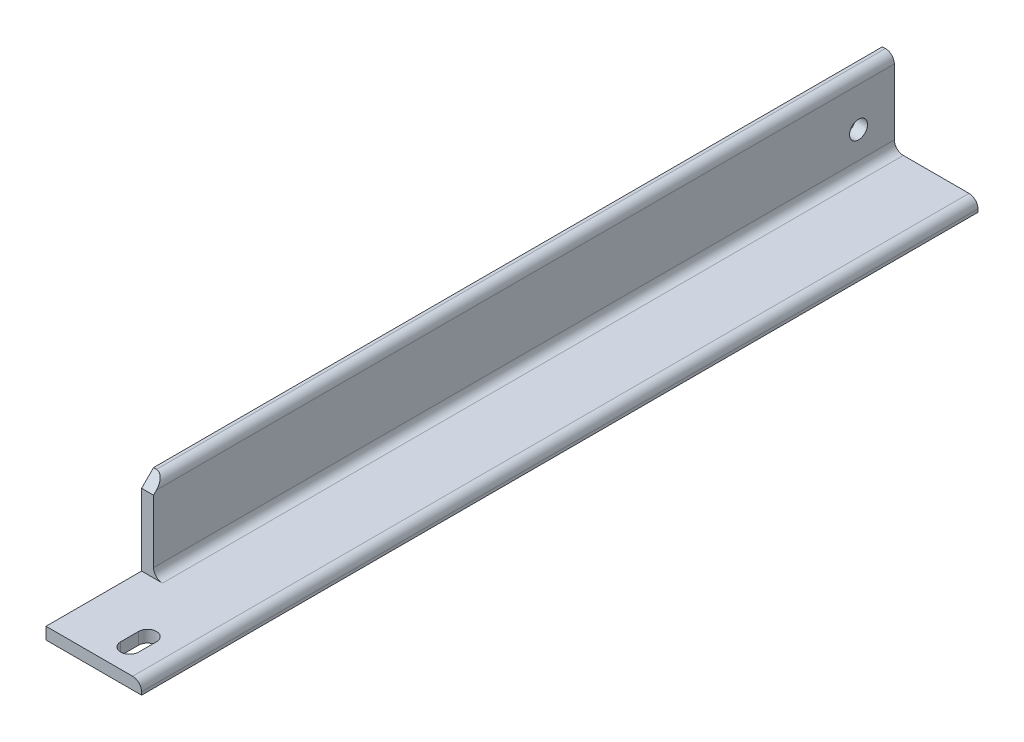
ISO-10303-21;
HEADER;
FILE_DESCRIPTION(('STEP AP214'),'2;1');
FILE_NAME('part.step','',(''),(''),'','','');
FILE_SCHEMA(('AUTOMOTIVE_DESIGN { 1 0 10303 214 1 1 1 1 }'));
ENDSEC;
DATA;
#1=APPLICATION_CONTEXT('core data for automotive mechanical design processes');
#2=APPLICATION_PROTOCOL_DEFINITION('international standard','automotive_design',2000,#1);
#3=PRODUCT_CONTEXT('',#1,'mechanical');
#4=PRODUCT('Part','Part','',(#3));
#5=PRODUCT_RELATED_PRODUCT_CATEGORY('part','',(#4));
#6=PRODUCT_DEFINITION_FORMATION('','',#4);
#7=PRODUCT_DEFINITION_CONTEXT('part definition',#1,'design');
#8=PRODUCT_DEFINITION('design','',#6,#7);
#9=PRODUCT_DEFINITION_SHAPE('','',#8);
#10=(LENGTH_UNIT() NAMED_UNIT(*) SI_UNIT(.MILLI.,.METRE.));
#11=(NAMED_UNIT(*) PLANE_ANGLE_UNIT() SI_UNIT($,.RADIAN.));
#12=(NAMED_UNIT(*) SI_UNIT($,.STERADIAN.) SOLID_ANGLE_UNIT());
#13=UNCERTAINTY_MEASURE_WITH_UNIT(LENGTH_MEASURE(1.E-05),#10,'distance_accuracy_value','');
#14=(GEOMETRIC_REPRESENTATION_CONTEXT(3) GLOBAL_UNCERTAINTY_ASSIGNED_CONTEXT((#13)) GLOBAL_UNIT_ASSIGNED_CONTEXT((#10,
#11,#12)) REPRESENTATION_CONTEXT('',''));
#15=CARTESIAN_POINT('',(0.,0.,0.));
#16=DIRECTION('',(0.,0.,1.));
#17=DIRECTION('',(1.,0.,0.));
#18=AXIS2_PLACEMENT_3D('',#15,#16,#17);
#19=CARTESIAN_POINT('',(0.,0.,444.5));
#20=DIRECTION('',(1.,0.,0.));
#21=DIRECTION('',(0.,0.,-1.));
#22=AXIS2_PLACEMENT_3D('',#19,#20,#21);
#23=PLANE('',#22);
#24=DIRECTION('',(0.,0.707106781186547,-0.707106781186548));
#25=VECTOR('',#24,1.);
#26=CARTESIAN_POINT('',(0.,88.9,342.9));
#27=LINE('',#26,#25);
#28=CARTESIAN_POINT('',(0.,88.9,342.9));
#29=VERTEX_POINT('',#28);
#30=CARTESIAN_POINT('',(0.,101.6,330.2));
#31=VERTEX_POINT('',#30);
#32=EDGE_CURVE('E184',#29,#31,#27,.T.);
#33=ORIENTED_EDGE('',*,*,#32,.T.);
#34=DIRECTION('',(0.,0.,-1.));
#35=VECTOR('',#34,1.);
#36=CARTESIAN_POINT('',(0.,101.6,444.5));
#37=LINE('',#36,#35);
#38=CARTESIAN_POINT('',(0.,101.6,-444.5));
#39=VERTEX_POINT('',#38);
#40=EDGE_CURVE('E240',#31,#39,#37,.T.);
#41=ORIENTED_EDGE('',*,*,#40,.T.);
#42=DIRECTION('',(0.,-1.,0.));
#43=VECTOR('',#42,1.);
#44=CARTESIAN_POINT('',(0.,0.,-444.5));
#45=LINE('',#44,#43);
#46=CARTESIAN_POINT('',(0.,0.,-444.5));
#47=VERTEX_POINT('',#46);
#48=EDGE_CURVE('E207',#39,#47,#45,.T.);
#49=ORIENTED_EDGE('',*,*,#48,.T.);
#50=DIRECTION('',(0.,0.,-1.));
#51=VECTOR('',#50,1.);
#52=CARTESIAN_POINT('',(0.,0.,444.5));
#53=LINE('',#52,#51);
#54=CARTESIAN_POINT('',(0.,0.,444.5));
#55=VERTEX_POINT('',#54);
#56=EDGE_CURVE('E215',#55,#47,#53,.T.);
#57=ORIENTED_EDGE('',*,*,#56,.F.);
#58=DIRECTION('',(0.,-1.,0.));
#59=VECTOR('',#58,1.);
#60=CARTESIAN_POINT('',(0.,0.,444.5));
#61=LINE('',#60,#59);
#62=CARTESIAN_POINT('',(0.,12.7,444.5));
#63=VERTEX_POINT('',#62);
#64=EDGE_CURVE('E213',#63,#55,#61,.T.);
#65=ORIENTED_EDGE('',*,*,#64,.F.);
#66=DIRECTION('',(0.,0.,-1.));
#67=VECTOR('',#66,1.);
#68=CARTESIAN_POINT('',(0.,12.7,444.5));
#69=LINE('',#68,#67);
#70=CARTESIAN_POINT('',(0.,12.7,342.9));
#71=VERTEX_POINT('',#70);
#72=EDGE_CURVE('E178',#63,#71,#69,.T.);
#73=ORIENTED_EDGE('',*,*,#72,.T.);
#74=DIRECTION('',(0.,1.,0.));
#75=VECTOR('',#74,1.);
#76=CARTESIAN_POINT('',(0.,12.7,342.9));
#77=LINE('',#76,#75);
#78=EDGE_CURVE('E181',#71,#29,#77,.T.);
#79=ORIENTED_EDGE('',*,*,#78,.T.);
#80=EDGE_LOOP('',(#33,#41,#49,#57,#65,#73,#79));
#81=FACE_BOUND('',#80,.T.);
#82=CARTESIAN_POINT('',(0.,50.8,-406.4));
#83=DIRECTION('',(-1.,0.,0.));
#84=DIRECTION('',(0.,0.,1.));
#85=AXIS2_PLACEMENT_3D('',#82,#83,#84);
#86=CIRCLE('',#85,9.52499999999998);
#87=CARTESIAN_POINT('',(0.,50.8,-396.875));
#88=VERTEX_POINT('',#87);
#89=EDGE_CURVE('E462',#88,#88,#86,.T.);
#90=ORIENTED_EDGE('',*,*,#89,.F.);
#91=EDGE_LOOP('',(#90));
#92=FACE_BOUND('',#91,.T.);
#93=ADVANCED_FACE('F35',(#81,#92),#23,.F.);
#94=CARTESIAN_POINT('',(101.6,0.,444.5));
#95=DIRECTION('',(0.,1.,0.));
#96=DIRECTION('',(-1.,0.,0.));
#97=AXIS2_PLACEMENT_3D('',#94,#95,#96);
#98=PLANE('',#97);
#99=DIRECTION('',(1.,0.,0.));
#100=VECTOR('',#99,1.);
#101=CARTESIAN_POINT('',(101.6,0.,-444.5));
#102=LINE('',#101,#100);
#103=CARTESIAN_POINT('',(101.6,0.,-444.5));
#104=VERTEX_POINT('',#103);
#105=EDGE_CURVE('E202',#47,#104,#102,.T.);
#106=ORIENTED_EDGE('',*,*,#105,.T.);
#107=DIRECTION('',(0.,0.,-1.));
#108=VECTOR('',#107,1.);
#109=CARTESIAN_POINT('',(101.6,0.,444.5));
#110=LINE('',#109,#108);
#111=CARTESIAN_POINT('',(101.6,0.,444.5));
#112=VERTEX_POINT('',#111);
#113=EDGE_CURVE('E11',#112,#104,#110,.T.);
#114=ORIENTED_EDGE('',*,*,#113,.F.);
#115=DIRECTION('',(1.,0.,0.));
#116=VECTOR('',#115,1.);
#117=CARTESIAN_POINT('',(101.6,0.,444.5));
#118=LINE('',#117,#116);
#119=EDGE_CURVE('E203',#55,#112,#118,.T.);
#120=ORIENTED_EDGE('',*,*,#119,.F.);
#121=ORIENTED_EDGE('',*,*,#56,.T.);
#122=EDGE_LOOP('',(#106,#114,#120,#121));
#123=FACE_BOUND('',#122,.T.);
#124=CARTESIAN_POINT('',(63.5,0.,419.1));
#125=DIRECTION('',(0.,1.,0.));
#126=DIRECTION('',(-1.,0.,0.));
#127=AXIS2_PLACEMENT_3D('',#124,#125,#126);
#128=CIRCLE('',#127,9.52500000000001);
#129=CARTESIAN_POINT('',(53.975,0.,419.1));
#130=VERTEX_POINT('',#129);
#131=CARTESIAN_POINT('',(73.025,0.,419.1));
#132=VERTEX_POINT('',#131);
#133=EDGE_CURVE('E50',#130,#132,#128,.T.);
#134=ORIENTED_EDGE('',*,*,#133,.T.);
#135=DIRECTION('',(0.,0.,-1.));
#136=VECTOR('',#135,1.);
#137=CARTESIAN_POINT('',(73.025,0.,419.1));
#138=LINE('',#137,#136);
#139=CARTESIAN_POINT('',(73.025,0.,400.05));
#140=VERTEX_POINT('',#139);
#141=EDGE_CURVE('E160',#132,#140,#138,.T.);
#142=ORIENTED_EDGE('',*,*,#141,.T.);
#143=CARTESIAN_POINT('',(63.5,0.,400.05));
#144=DIRECTION('',(0.,1.,0.));
#145=DIRECTION('',(-1.,0.,0.));
#146=AXIS2_PLACEMENT_3D('',#143,#144,#145);
#147=CIRCLE('',#146,9.52500000000001);
#148=CARTESIAN_POINT('',(53.975,0.,400.05));
#149=VERTEX_POINT('',#148);
#150=EDGE_CURVE('E168',#140,#149,#147,.T.);
#151=ORIENTED_EDGE('',*,*,#150,.T.);
#152=DIRECTION('',(0.,0.,1.));
#153=VECTOR('',#152,1.);
#154=CARTESIAN_POINT('',(53.975,0.,419.1));
#155=LINE('',#154,#153);
#156=EDGE_CURVE('E154',#149,#130,#155,.T.);
#157=ORIENTED_EDGE('',*,*,#156,.T.);
#158=EDGE_LOOP('',(#134,#142,#151,#157));
#159=FACE_BOUND('',#158,.T.);
#160=ADVANCED_FACE('F37',(#123,#159),#98,.F.);
#161=CARTESIAN_POINT('',(22.225,12.7,444.5));
#162=DIRECTION('',(0.,-1.,0.));
#163=DIRECTION('',(1.,0.,0.));
#164=AXIS2_PLACEMENT_3D('',#161,#162,#163);
#165=PLANE('',#164);
#166=DIRECTION('',(-1.,0.,0.));
#167=VECTOR('',#166,1.);
#168=CARTESIAN_POINT('',(22.225,12.7,-444.5));
#169=LINE('',#168,#167);
#170=CARTESIAN_POINT('',(92.08008,12.7,-444.5));
#171=VERTEX_POINT('',#170);
#172=CARTESIAN_POINT('',(22.225,12.7,-444.5));
#173=VERTEX_POINT('',#172);
#174=EDGE_CURVE('E222',#171,#173,#169,.T.);
#175=ORIENTED_EDGE('',*,*,#174,.T.);
#176=DIRECTION('',(0.,0.,-1.));
#177=VECTOR('',#176,1.);
#178=CARTESIAN_POINT('',(22.225,12.7,444.5));
#179=LINE('',#178,#177);
#180=CARTESIAN_POINT('',(22.225,12.7,342.9));
#181=VERTEX_POINT('',#180);
#182=EDGE_CURVE('E248',#181,#173,#179,.T.);
#183=ORIENTED_EDGE('',*,*,#182,.F.);
#184=DIRECTION('',(-1.,0.,0.));
#185=VECTOR('',#184,1.);
#186=CARTESIAN_POINT('',(101.601,12.7,342.9));
#187=LINE('',#186,#185);
#188=EDGE_CURVE('E191',#181,#71,#187,.T.);
#189=ORIENTED_EDGE('',*,*,#188,.T.);
#190=ORIENTED_EDGE('',*,*,#72,.F.);
#191=DIRECTION('',(-1.,0.,0.));
#192=VECTOR('',#191,1.);
#193=CARTESIAN_POINT('',(22.225,12.7,444.5));
#194=LINE('',#193,#192);
#195=CARTESIAN_POINT('',(92.08008,12.7,444.5));
#196=VERTEX_POINT('',#195);
#197=EDGE_CURVE('E211',#196,#63,#194,.T.);
#198=ORIENTED_EDGE('',*,*,#197,.F.);
#199=DIRECTION('',(0.,0.,-1.));
#200=VECTOR('',#199,1.);
#201=CARTESIAN_POINT('',(92.08008,12.7,444.5));
#202=LINE('',#201,#200);
#203=EDGE_CURVE('E250',#196,#171,#202,.T.);
#204=ORIENTED_EDGE('',*,*,#203,.T.);
#205=EDGE_LOOP('',(#175,#183,#189,#190,#198,#204));
#206=FACE_BOUND('',#205,.T.);
#207=CARTESIAN_POINT('',(63.5,12.7,419.1));
#208=DIRECTION('',(0.,-1.,0.));
#209=DIRECTION('',(1.,0.,0.));
#210=AXIS2_PLACEMENT_3D('',#207,#208,#209);
#211=CIRCLE('',#210,9.52500000000001);
#212=CARTESIAN_POINT('',(73.025,12.7,419.1));
#213=VERTEX_POINT('',#212);
#214=CARTESIAN_POINT('',(53.975,12.7,419.1));
#215=VERTEX_POINT('',#214);
#216=EDGE_CURVE('E152',#213,#215,#211,.T.);
#217=ORIENTED_EDGE('',*,*,#216,.T.);
#218=DIRECTION('',(0.,0.,-1.));
#219=VECTOR('',#218,1.);
#220=CARTESIAN_POINT('',(53.975,12.7,419.1));
#221=LINE('',#220,#219);
#222=CARTESIAN_POINT('',(53.975,12.7,400.05));
#223=VERTEX_POINT('',#222);
#224=EDGE_CURVE('E141',#215,#223,#221,.T.);
#225=ORIENTED_EDGE('',*,*,#224,.T.);
#226=CARTESIAN_POINT('',(63.5,12.7,400.05));
#227=DIRECTION('',(0.,-1.,0.));
#228=DIRECTION('',(1.,0.,0.));
#229=AXIS2_PLACEMENT_3D('',#226,#227,#228);
#230=CIRCLE('',#229,9.52500000000001);
#231=CARTESIAN_POINT('',(73.025,12.7,400.05));
#232=VERTEX_POINT('',#231);
#233=EDGE_CURVE('E162',#223,#232,#230,.T.);
#234=ORIENTED_EDGE('',*,*,#233,.T.);
#235=DIRECTION('',(0.,0.,1.));
#236=VECTOR('',#235,1.);
#237=CARTESIAN_POINT('',(73.025,12.7,419.1));
#238=LINE('',#237,#236);
#239=EDGE_CURVE('E158',#232,#213,#238,.T.);
#240=ORIENTED_EDGE('',*,*,#239,.T.);
#241=EDGE_LOOP('',(#217,#225,#234,#240));
#242=FACE_BOUND('',#241,.T.);
#243=ADVANCED_FACE('F157',(#206,#242),#165,.F.);
#244=CARTESIAN_POINT('',(22.225,22.225,444.5));
#245=DIRECTION('',(0.,0.,-1.));
#246=DIRECTION('',(-1.,0.,0.));
#247=AXIS2_PLACEMENT_3D('',#244,#245,#246);
#248=CYLINDRICAL_SURFACE('',#247,9.525);
#249=CARTESIAN_POINT('',(22.225,22.225,342.9));
#250=DIRECTION('',(0.,0.,1.));
#251=DIRECTION('',(1.,0.,0.));
#252=AXIS2_PLACEMENT_3D('',#249,#250,#251);
#253=CIRCLE('',#252,9.525);
#254=CARTESIAN_POINT('',(12.7,22.225,342.9));
#255=VERTEX_POINT('',#254);
#256=EDGE_CURVE('E199',#255,#181,#253,.T.);
#257=ORIENTED_EDGE('',*,*,#256,.T.);
#258=ORIENTED_EDGE('',*,*,#182,.T.);
#259=CARTESIAN_POINT('',(22.225,22.225,-444.5));
#260=DIRECTION('',(0.,0.,-1.));
#261=DIRECTION('',(-1.,0.,0.));
#262=AXIS2_PLACEMENT_3D('',#259,#260,#261);
#263=CIRCLE('',#262,9.525);
#264=CARTESIAN_POINT('',(12.7,22.225,-444.5));
#265=VERTEX_POINT('',#264);
#266=EDGE_CURVE('E225',#173,#265,#263,.T.);
#267=ORIENTED_EDGE('',*,*,#266,.T.);
#268=DIRECTION('',(0.,0.,-1.));
#269=VECTOR('',#268,1.);
#270=CARTESIAN_POINT('',(12.7,22.225,444.5));
#271=LINE('',#270,#269);
#272=EDGE_CURVE('E246',#255,#265,#271,.T.);
#273=ORIENTED_EDGE('',*,*,#272,.F.);
#274=EDGE_LOOP('',(#257,#258,#267,#273));
#275=FACE_BOUND('',#274,.T.);
#276=ADVANCED_FACE('F297',(#275),#248,.F.);
#277=CARTESIAN_POINT('',(12.7,92.08008,444.5));
#278=DIRECTION('',(-1.,0.,0.));
#279=DIRECTION('',(0.,-1.,0.));
#280=AXIS2_PLACEMENT_3D('',#277,#278,#279);
#281=PLANE('',#280);
#282=CARTESIAN_POINT('',(12.7,50.8,-406.4));
#283=DIRECTION('',(-1.,0.,0.));
#284=DIRECTION('',(0.,-1.,0.));
#285=AXIS2_PLACEMENT_3D('',#282,#283,#284);
#286=CIRCLE('',#285,9.52499999999999);
#287=CARTESIAN_POINT('',(12.7,41.275,-406.4));
#288=VERTEX_POINT('',#287);
#289=EDGE_CURVE('E459',#288,#288,#286,.T.);
#290=ORIENTED_EDGE('',*,*,#289,.T.);
#291=EDGE_LOOP('',(#290));
#292=FACE_BOUND('',#291,.T.);
#293=DIRECTION('',(0.,-1.,0.));
#294=VECTOR('',#293,1.);
#295=CARTESIAN_POINT('',(12.7,12.7,342.9));
#296=LINE('',#295,#294);
#297=CARTESIAN_POINT('',(12.7,88.9,342.9));
#298=VERTEX_POINT('',#297);
#299=EDGE_CURVE('E148',#298,#255,#296,.T.);
#300=ORIENTED_EDGE('',*,*,#299,.T.);
#301=ORIENTED_EDGE('',*,*,#272,.T.);
#302=DIRECTION('',(0.,1.,0.));
#303=VECTOR('',#302,1.);
#304=CARTESIAN_POINT('',(12.7,92.08008,-444.5));
#305=LINE('',#304,#303);
#306=CARTESIAN_POINT('',(12.7,92.08008,-444.5));
#307=VERTEX_POINT('',#306);
#308=EDGE_CURVE('E228',#265,#307,#305,.T.);
#309=ORIENTED_EDGE('',*,*,#308,.T.);
#310=DIRECTION('',(0.,0.,-1.));
#311=VECTOR('',#310,1.);
#312=CARTESIAN_POINT('',(12.7,92.08008,444.5));
#313=LINE('',#312,#311);
#314=CARTESIAN_POINT('',(12.7,92.08008,339.71992));
#315=VERTEX_POINT('',#314);
#316=EDGE_CURVE('E244',#315,#307,#313,.T.);
#317=ORIENTED_EDGE('',*,*,#316,.F.);
#318=DIRECTION('',(0.,-0.707106781186547,0.707106781186548));
#319=VECTOR('',#318,1.);
#320=CARTESIAN_POINT('',(12.7,88.9,342.9));
#321=LINE('',#320,#319);
#322=EDGE_CURVE('E196',#315,#298,#321,.T.);
#323=ORIENTED_EDGE('',*,*,#322,.T.);
#324=EDGE_LOOP('',(#300,#301,#309,#317,#323));
#325=FACE_BOUND('',#324,.T.);
#326=ADVANCED_FACE('F294',(#292,#325),#281,.F.);
#327=CARTESIAN_POINT('',(3.18008,92.08008,444.5));
#328=DIRECTION('',(0.,0.,-1.));
#329=DIRECTION('',(-1.,0.,0.));
#330=AXIS2_PLACEMENT_3D('',#327,#328,#329);
#331=CYLINDRICAL_SURFACE('',#330,9.51992);
#332=CARTESIAN_POINT('',(3.18008,92.08008,339.71992));
#333=DIRECTION('',(0.,0.707106781186548,0.707106781186547));
#334=DIRECTION('',(0.,0.707106781186547,-0.707106781186548));
#335=AXIS2_PLACEMENT_3D('',#332,#333,#334);
#336=ELLIPSE('',#335,13.4631999767069,9.51992);
#337=CARTESIAN_POINT('',(3.18008,101.6,330.2));
#338=VERTEX_POINT('',#337);
#339=EDGE_CURVE('E193',#338,#315,#336,.F.);
#340=ORIENTED_EDGE('',*,*,#339,.T.);
#341=ORIENTED_EDGE('',*,*,#316,.T.);
#342=CARTESIAN_POINT('',(3.18008,92.08008,-444.5));
#343=DIRECTION('',(0.,0.,1.));
#344=DIRECTION('',(-1.,0.,0.));
#345=AXIS2_PLACEMENT_3D('',#342,#343,#344);
#346=CIRCLE('',#345,9.51992);
#347=CARTESIAN_POINT('',(3.18008,101.6,-444.5));
#348=VERTEX_POINT('',#347);
#349=EDGE_CURVE('E231',#307,#348,#346,.T.);
#350=ORIENTED_EDGE('',*,*,#349,.T.);
#351=DIRECTION('',(0.,0.,-1.));
#352=VECTOR('',#351,1.);
#353=CARTESIAN_POINT('',(3.18008,101.6,444.5));
#354=LINE('',#353,#352);
#355=EDGE_CURVE('E242',#338,#348,#354,.T.);
#356=ORIENTED_EDGE('',*,*,#355,.F.);
#357=EDGE_LOOP('',(#340,#341,#350,#356));
#358=FACE_BOUND('',#357,.T.);
#359=ADVANCED_FACE('F291',(#358),#331,.T.);
#360=CARTESIAN_POINT('',(0.,101.6,444.5));
#361=DIRECTION('',(0.,-1.,0.));
#362=DIRECTION('',(0.,0.,-1.));
#363=AXIS2_PLACEMENT_3D('',#360,#361,#362);
#364=PLANE('',#363);
#365=DIRECTION('',(-1.,0.,0.));
#366=VECTOR('',#365,1.);
#367=CARTESIAN_POINT('',(101.601,101.6,330.2));
#368=LINE('',#367,#366);
#369=EDGE_CURVE('E187',#338,#31,#368,.T.);
#370=ORIENTED_EDGE('',*,*,#369,.F.);
#371=ORIENTED_EDGE('',*,*,#355,.T.);
#372=DIRECTION('',(-1.,0.,0.));
#373=VECTOR('',#372,1.);
#374=CARTESIAN_POINT('',(0.,101.6,-444.5));
#375=LINE('',#374,#373);
#376=EDGE_CURVE('E234',#348,#39,#375,.T.);
#377=ORIENTED_EDGE('',*,*,#376,.T.);
#378=ORIENTED_EDGE('',*,*,#40,.F.);
#379=EDGE_LOOP('',(#370,#371,#377,#378));
#380=FACE_BOUND('',#379,.T.);
#381=ADVANCED_FACE('F288',(#380),#364,.F.);
#382=CARTESIAN_POINT('',(3.18008,92.08008,444.5));
#383=DIRECTION('',(0.,0.,-1.));
#384=DIRECTION('',(-1.,0.,0.));
#385=AXIS2_PLACEMENT_3D('',#382,#383,#384);
#386=PLANE('',#385);
#387=ORIENTED_EDGE('',*,*,#197,.T.);
#388=ORIENTED_EDGE('',*,*,#64,.T.);
#389=ORIENTED_EDGE('',*,*,#119,.T.);
#390=DIRECTION('',(0.,1.,0.));
#391=VECTOR('',#390,1.);
#392=CARTESIAN_POINT('',(101.6,3.18008,444.5));
#393=LINE('',#392,#391);
#394=CARTESIAN_POINT('',(101.6,3.18008,444.5));
#395=VERTEX_POINT('',#394);
#396=EDGE_CURVE('E206',#112,#395,#393,.T.);
#397=ORIENTED_EDGE('',*,*,#396,.T.);
#398=CARTESIAN_POINT('',(92.08008,3.18008,444.5));
#399=DIRECTION('',(0.,0.,1.));
#400=DIRECTION('',(1.,0.,0.));
#401=AXIS2_PLACEMENT_3D('',#398,#399,#400);
#402=CIRCLE('',#401,9.51991999999999);
#403=EDGE_CURVE('E209',#395,#196,#402,.T.);
#404=ORIENTED_EDGE('',*,*,#403,.T.);
#405=EDGE_LOOP('',(#387,#388,#389,#397,#404));
#406=FACE_BOUND('',#405,.T.);
#407=ADVANCED_FACE('F272',(#406),#386,.F.);
#408=CARTESIAN_POINT('',(101.6,3.18008,444.5));
#409=DIRECTION('',(-1.,0.,0.));
#410=DIRECTION('',(0.,0.,1.));
#411=AXIS2_PLACEMENT_3D('',#408,#409,#410);
#412=PLANE('',#411);
#413=DIRECTION('',(0.,1.,0.));
#414=VECTOR('',#413,1.);
#415=CARTESIAN_POINT('',(101.6,3.18008,-444.5));
#416=LINE('',#415,#414);
#417=CARTESIAN_POINT('',(101.6,3.18008,-444.5));
#418=VERTEX_POINT('',#417);
#419=EDGE_CURVE('E218',#104,#418,#416,.T.);
#420=ORIENTED_EDGE('',*,*,#419,.T.);
#421=DIRECTION('',(0.,0.,-1.));
#422=VECTOR('',#421,1.);
#423=CARTESIAN_POINT('',(101.6,3.18008,444.5));
#424=LINE('',#423,#422);
#425=EDGE_CURVE('E43',#395,#418,#424,.T.);
#426=ORIENTED_EDGE('',*,*,#425,.F.);
#427=ORIENTED_EDGE('',*,*,#396,.F.);
#428=ORIENTED_EDGE('',*,*,#113,.T.);
#429=EDGE_LOOP('',(#420,#426,#427,#428));
#430=FACE_BOUND('',#429,.T.);
#431=ADVANCED_FACE('F276',(#430),#412,.F.);
#432=CARTESIAN_POINT('',(92.08008,3.18008,444.5));
#433=DIRECTION('',(0.,0.,-1.));
#434=DIRECTION('',(-1.,0.,0.));
#435=AXIS2_PLACEMENT_3D('',#432,#433,#434);
#436=CYLINDRICAL_SURFACE('',#435,9.51991999999999);
#437=CARTESIAN_POINT('',(92.08008,3.18008,-444.5));
#438=DIRECTION('',(0.,0.,1.));
#439=DIRECTION('',(1.,0.,0.));
#440=AXIS2_PLACEMENT_3D('',#437,#438,#439);
#441=CIRCLE('',#440,9.51991999999999);
#442=EDGE_CURVE('E220',#418,#171,#441,.T.);
#443=ORIENTED_EDGE('',*,*,#442,.T.);
#444=ORIENTED_EDGE('',*,*,#203,.F.);
#445=ORIENTED_EDGE('',*,*,#403,.F.);
#446=ORIENTED_EDGE('',*,*,#425,.T.);
#447=EDGE_LOOP('',(#443,#444,#445,#446));
#448=FACE_BOUND('',#447,.T.);
#449=ADVANCED_FACE('F257',(#448),#436,.T.);
#450=CARTESIAN_POINT('',(3.18008,92.08008,-444.5));
#451=DIRECTION('',(0.,0.,-1.));
#452=DIRECTION('',(-1.,0.,0.));
#453=AXIS2_PLACEMENT_3D('',#450,#451,#452);
#454=PLANE('',#453);
#455=ORIENTED_EDGE('',*,*,#105,.F.);
#456=ORIENTED_EDGE('',*,*,#48,.F.);
#457=ORIENTED_EDGE('',*,*,#376,.F.);
#458=ORIENTED_EDGE('',*,*,#349,.F.);
#459=ORIENTED_EDGE('',*,*,#308,.F.);
#460=ORIENTED_EDGE('',*,*,#266,.F.);
#461=ORIENTED_EDGE('',*,*,#174,.F.);
#462=ORIENTED_EDGE('',*,*,#442,.F.);
#463=ORIENTED_EDGE('',*,*,#419,.F.);
#464=EDGE_LOOP('',(#455,#456,#457,#458,#459,#460,#461,#462,#463));
#465=FACE_BOUND('',#464,.T.);
#466=ADVANCED_FACE('F263',(#465),#454,.T.);
#467=CARTESIAN_POINT('',(101.601,12.7,342.9));
#468=DIRECTION('',(0.,0.,1.));
#469=DIRECTION('',(1.,0.,0.));
#470=AXIS2_PLACEMENT_3D('',#467,#468,#469);
#471=PLANE('',#470);
#472=ORIENTED_EDGE('',*,*,#299,.F.);
#473=DIRECTION('',(-1.,0.,0.));
#474=VECTOR('',#473,1.);
#475=CARTESIAN_POINT('',(101.601,88.9,342.9));
#476=LINE('',#475,#474);
#477=EDGE_CURVE('E189',#298,#29,#476,.T.);
#478=ORIENTED_EDGE('',*,*,#477,.T.);
#479=ORIENTED_EDGE('',*,*,#78,.F.);
#480=ORIENTED_EDGE('',*,*,#188,.F.);
#481=ORIENTED_EDGE('',*,*,#256,.F.);
#482=EDGE_LOOP('',(#472,#478,#479,#480,#481));
#483=FACE_BOUND('',#482,.T.);
#484=ADVANCED_FACE('F299',(#483),#471,.T.);
#485=CARTESIAN_POINT('',(101.601,88.9,342.9));
#486=DIRECTION('',(0.,0.707106781186548,0.707106781186547));
#487=DIRECTION('',(0.,-0.707106781186547,0.707106781186548));
#488=AXIS2_PLACEMENT_3D('',#485,#486,#487);
#489=PLANE('',#488);
#490=ORIENTED_EDGE('',*,*,#339,.F.);
#491=ORIENTED_EDGE('',*,*,#369,.T.);
#492=ORIENTED_EDGE('',*,*,#32,.F.);
#493=ORIENTED_EDGE('',*,*,#477,.F.);
#494=ORIENTED_EDGE('',*,*,#322,.F.);
#495=EDGE_LOOP('',(#490,#491,#492,#493,#494));
#496=FACE_BOUND('',#495,.T.);
#497=ADVANCED_FACE('F303',(#496),#489,.T.);
#498=CARTESIAN_POINT('',(63.5,101.601,419.1));
#499=DIRECTION('',(0.,-1.,0.));
#500=DIRECTION('',(1.,0.,0.));
#501=AXIS2_PLACEMENT_3D('',#498,#499,#500);
#502=CYLINDRICAL_SURFACE('',#501,9.52500000000001);
#503=DIRECTION('',(0.,-1.,0.));
#504=VECTOR('',#503,1.);
#505=CARTESIAN_POINT('',(73.025,101.601,419.1));
#506=LINE('',#505,#504);
#507=EDGE_CURVE('E149',#213,#132,#506,.T.);
#508=ORIENTED_EDGE('',*,*,#507,.T.);
#509=ORIENTED_EDGE('',*,*,#133,.F.);
#510=DIRECTION('',(0.,-1.,0.));
#511=VECTOR('',#510,1.);
#512=CARTESIAN_POINT('',(53.975,101.601,419.1));
#513=LINE('',#512,#511);
#514=EDGE_CURVE('E143',#215,#130,#513,.T.);
#515=ORIENTED_EDGE('',*,*,#514,.F.);
#516=ORIENTED_EDGE('',*,*,#216,.F.);
#517=EDGE_LOOP('',(#508,#509,#515,#516));
#518=FACE_BOUND('',#517,.T.);
#519=ADVANCED_FACE('F151',(#518),#502,.F.);
#520=CARTESIAN_POINT('',(73.025,101.601,419.1));
#521=DIRECTION('',(-1.,0.,0.));
#522=DIRECTION('',(0.,-1.,0.));
#523=AXIS2_PLACEMENT_3D('',#520,#521,#522);
#524=PLANE('',#523);
#525=DIRECTION('',(0.,-1.,0.));
#526=VECTOR('',#525,1.);
#527=CARTESIAN_POINT('',(73.025,101.601,400.05));
#528=LINE('',#527,#526);
#529=EDGE_CURVE('E173',#232,#140,#528,.T.);
#530=ORIENTED_EDGE('',*,*,#529,.T.);
#531=ORIENTED_EDGE('',*,*,#141,.F.);
#532=ORIENTED_EDGE('',*,*,#507,.F.);
#533=ORIENTED_EDGE('',*,*,#239,.F.);
#534=EDGE_LOOP('',(#530,#531,#532,#533));
#535=FACE_BOUND('',#534,.T.);
#536=ADVANCED_FACE('F310',(#535),#524,.T.);
#537=CARTESIAN_POINT('',(63.5,101.601,400.05));
#538=DIRECTION('',(0.,-1.,0.));
#539=DIRECTION('',(1.,0.,0.));
#540=AXIS2_PLACEMENT_3D('',#537,#538,#539);
#541=CYLINDRICAL_SURFACE('',#540,9.52500000000001);
#542=DIRECTION('',(0.,-1.,0.));
#543=VECTOR('',#542,1.);
#544=CARTESIAN_POINT('',(53.975,101.601,400.05));
#545=LINE('',#544,#543);
#546=EDGE_CURVE('E58',#223,#149,#545,.T.);
#547=ORIENTED_EDGE('',*,*,#546,.T.);
#548=ORIENTED_EDGE('',*,*,#150,.F.);
#549=ORIENTED_EDGE('',*,*,#529,.F.);
#550=ORIENTED_EDGE('',*,*,#233,.F.);
#551=EDGE_LOOP('',(#547,#548,#549,#550));
#552=FACE_BOUND('',#551,.T.);
#553=ADVANCED_FACE('F421',(#552),#541,.F.);
#554=CARTESIAN_POINT('',(53.975,101.601,419.1));
#555=DIRECTION('',(1.,0.,0.));
#556=DIRECTION('',(0.,1.,0.));
#557=AXIS2_PLACEMENT_3D('',#554,#555,#556);
#558=PLANE('',#557);
#559=ORIENTED_EDGE('',*,*,#514,.T.);
#560=ORIENTED_EDGE('',*,*,#156,.F.);
#561=ORIENTED_EDGE('',*,*,#546,.F.);
#562=ORIENTED_EDGE('',*,*,#224,.F.);
#563=EDGE_LOOP('',(#559,#560,#561,#562));
#564=FACE_BOUND('',#563,.T.);
#565=ADVANCED_FACE('F142',(#564),#558,.T.);
#566=CARTESIAN_POINT('',(0.,50.8,-406.4));
#567=DIRECTION('',(-1.,0.,0.));
#568=DIRECTION('',(0.,0.,1.));
#569=AXIS2_PLACEMENT_3D('',#566,#567,#568);
#570=CYLINDRICAL_SURFACE('',#569,9.52499999999999);
#571=ORIENTED_EDGE('',*,*,#289,.F.);
#572=EDGE_LOOP('',(#571));
#573=FACE_BOUND('',#572,.T.);
#574=ORIENTED_EDGE('',*,*,#89,.T.);
#575=EDGE_LOOP('',(#574));
#576=FACE_BOUND('',#575,.T.);
#577=ADVANCED_FACE('F438',(#573,#576),#570,.F.);
#578=CLOSED_SHELL('',(#93,#160,#243,#276,#326,#359,#381,#407,#431,#449,#466,#484,#497,#519,#536,
#553,#565,#577));
#579=MANIFOLD_SOLID_BREP('B2',#578);
#580=ADVANCED_BREP_SHAPE_REPRESENTATION('',(#18,#579),#14);
#581=SHAPE_DEFINITION_REPRESENTATION(#9,#580);
ENDSEC;
END-ISO-10303-21;
